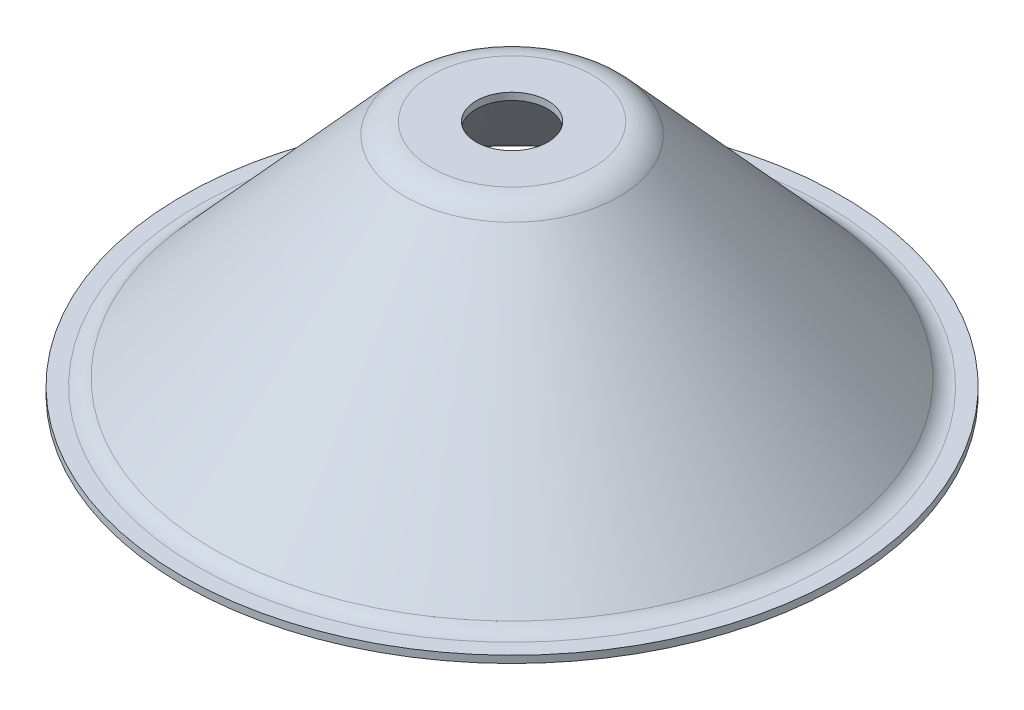
ISO-10303-21;
HEADER;
FILE_DESCRIPTION(('STEP AP214'),'2;1');
FILE_NAME('part.step','',(''),(''),'','','');
FILE_SCHEMA(('AUTOMOTIVE_DESIGN { 1 0 10303 214 1 1 1 1 }'));
ENDSEC;
DATA;
#1=APPLICATION_CONTEXT('core data for automotive mechanical design processes');
#2=APPLICATION_PROTOCOL_DEFINITION('international standard','automotive_design',2000,#1);
#3=PRODUCT_CONTEXT('',#1,'mechanical');
#4=PRODUCT('Part','Part','',(#3));
#5=PRODUCT_RELATED_PRODUCT_CATEGORY('part','',(#4));
#6=PRODUCT_DEFINITION_FORMATION('','',#4);
#7=PRODUCT_DEFINITION_CONTEXT('part definition',#1,'design');
#8=PRODUCT_DEFINITION('design','',#6,#7);
#9=PRODUCT_DEFINITION_SHAPE('','',#8);
#10=(LENGTH_UNIT() NAMED_UNIT(*) SI_UNIT(.MILLI.,.METRE.));
#11=(NAMED_UNIT(*) PLANE_ANGLE_UNIT() SI_UNIT($,.RADIAN.));
#12=(NAMED_UNIT(*) SI_UNIT($,.STERADIAN.) SOLID_ANGLE_UNIT());
#13=UNCERTAINTY_MEASURE_WITH_UNIT(LENGTH_MEASURE(1.E-05),#10,'distance_accuracy_value','');
#14=(GEOMETRIC_REPRESENTATION_CONTEXT(3) GLOBAL_UNCERTAINTY_ASSIGNED_CONTEXT((#13)) GLOBAL_UNIT_ASSIGNED_CONTEXT((#10,
#11,#12)) REPRESENTATION_CONTEXT('',''));
#15=CARTESIAN_POINT('',(0.,0.,0.));
#16=DIRECTION('',(0.,0.,1.));
#17=DIRECTION('',(1.,0.,0.));
#18=AXIS2_PLACEMENT_3D('',#15,#16,#17);
#19=CARTESIAN_POINT('',(11.2267942795777,1.,0.));
#20=DIRECTION('',(0.,-1.,0.));
#21=DIRECTION('',(0.,0.,-1.));
#22=AXIS2_PLACEMENT_3D('',#19,#20,#21);
#23=PLANE('',#22);
#24=CARTESIAN_POINT('',(0.,1.,0.));
#25=DIRECTION('',(0.,1.,0.));
#26=DIRECTION('',(0.,0.,1.));
#27=AXIS2_PLACEMENT_3D('',#24,#25,#26);
#28=CIRCLE('',#27,5.);
#29=CARTESIAN_POINT('',(0.,1.,5.));
#30=VERTEX_POINT('',#29);
#31=EDGE_CURVE('E10',#30,#30,#28,.T.);
#32=ORIENTED_EDGE('',*,*,#31,.F.);
#33=EDGE_LOOP('',(#32));
#34=FACE_BOUND('',#33,.T.);
#35=CARTESIAN_POINT('',(0.,1.,0.));
#36=DIRECTION('',(0.,1.,0.));
#37=DIRECTION('',(0.,0.,1.));
#38=AXIS2_PLACEMENT_3D('',#35,#36,#37);
#39=CIRCLE('',#38,11.2267942795777);
#40=CARTESIAN_POINT('',(0.,1.,11.2267942795777));
#41=VERTEX_POINT('',#40);
#42=EDGE_CURVE('E79',#41,#41,#39,.T.);
#43=ORIENTED_EDGE('',*,*,#42,.T.);
#44=EDGE_LOOP('',(#43));
#45=FACE_BOUND('',#44,.T.);
#46=ADVANCED_FACE('F39',(#34,#45),#23,.F.);
#47=CARTESIAN_POINT('',(0.,23.4158415841584,0.));
#48=DIRECTION('',(0.,1.,0.));
#49=DIRECTION('',(0.,0.,1.));
#50=AXIS2_PLACEMENT_3D('',#47,#48,#49);
#51=CYLINDRICAL_SURFACE('',#50,5.);
#52=ORIENTED_EDGE('',*,*,#31,.T.);
#53=EDGE_LOOP('',(#52));
#54=FACE_BOUND('',#53,.T.);
#55=CARTESIAN_POINT('',(0.,0.,0.));
#56=DIRECTION('',(0.,1.,0.));
#57=DIRECTION('',(0.,0.,1.));
#58=AXIS2_PLACEMENT_3D('',#55,#56,#57);
#59=CIRCLE('',#58,5.);
#60=CARTESIAN_POINT('',(0.,0.,5.));
#61=VERTEX_POINT('',#60);
#62=EDGE_CURVE('E45',#61,#61,#59,.T.);
#63=ORIENTED_EDGE('',*,*,#62,.F.);
#64=EDGE_LOOP('',(#63));
#65=FACE_BOUND('',#64,.T.);
#66=ADVANCED_FACE('F120',(#54,#65),#51,.F.);
#67=CARTESIAN_POINT('',(11.2267942795777,0.,0.));
#68=DIRECTION('',(0.,-1.,0.));
#69=DIRECTION('',(0.,0.,-1.));
#70=AXIS2_PLACEMENT_3D('',#67,#68,#69);
#71=PLANE('',#70);
#72=ORIENTED_EDGE('',*,*,#62,.T.);
#73=EDGE_LOOP('',(#72));
#74=FACE_BOUND('',#73,.T.);
#75=CARTESIAN_POINT('',(0.,0.,0.));
#76=DIRECTION('',(0.,1.,0.));
#77=DIRECTION('',(0.,0.,1.));
#78=AXIS2_PLACEMENT_3D('',#75,#76,#77);
#79=CIRCLE('',#78,11.2267942795777);
#80=CARTESIAN_POINT('',(0.,0.,11.2267942795777));
#81=VERTEX_POINT('',#80);
#82=EDGE_CURVE('E49',#81,#81,#79,.T.);
#83=ORIENTED_EDGE('',*,*,#82,.F.);
#84=EDGE_LOOP('',(#83));
#85=FACE_BOUND('',#84,.T.);
#86=ADVANCED_FACE('F125',(#74,#85),#71,.T.);
#87=CARTESIAN_POINT('',(0.,-4.,0.));
#88=DIRECTION('',(0.,1.,0.));
#89=DIRECTION('',(0.,0.,1.));
#90=AXIS2_PLACEMENT_3D('',#87,#88,#89);
#91=TOROIDAL_SURFACE('',#90,11.2267942795777,4.);
#92=ORIENTED_EDGE('',*,*,#82,.T.);
#93=EDGE_LOOP('',(#92));
#94=FACE_BOUND('',#93,.T.);
#95=CARTESIAN_POINT('',(0.,-1.31392230104456,0.));
#96=DIRECTION('',(0.,1.,0.));
#97=DIRECTION('',(0.,0.,1.));
#98=AXIS2_PLACEMENT_3D('',#95,#96,#97);
#99=CIRCLE('',#98,14.1907420853216);
#100=CARTESIAN_POINT('',(0.,-1.31392230104456,14.1907420853216));
#101=VERTEX_POINT('',#100);
#102=EDGE_CURVE('E53',#101,#101,#99,.T.);
#103=ORIENTED_EDGE('',*,*,#102,.F.);
#104=EDGE_LOOP('',(#103));
#105=FACE_BOUND('',#104,.T.);
#106=ADVANCED_FACE('F129',(#94,#105),#91,.F.);
#107=CARTESIAN_POINT('',(0.,-30.6860776989554,0.));
#108=DIRECTION('',(0.,-1.,0.));
#109=DIRECTION('',(0.,0.,-1.));
#110=AXIS2_PLACEMENT_3D('',#107,#108,#109);
#111=CONICAL_SURFACE('',#110,40.8092579146784,0.736257428981428);
#112=ORIENTED_EDGE('',*,*,#102,.T.);
#113=EDGE_LOOP('',(#112));
#114=FACE_BOUND('',#113,.T.);
#115=CARTESIAN_POINT('',(0.,-30.6860776989554,0.));
#116=DIRECTION('',(0.,1.,0.));
#117=DIRECTION('',(0.,0.,1.));
#118=AXIS2_PLACEMENT_3D('',#115,#116,#117);
#119=CIRCLE('',#118,40.8092579146784);
#120=CARTESIAN_POINT('',(0.,-30.6860776989554,40.8092579146784));
#121=VERTEX_POINT('',#120);
#122=EDGE_CURVE('E58',#121,#121,#119,.T.);
#123=ORIENTED_EDGE('',*,*,#122,.F.);
#124=EDGE_LOOP('',(#123));
#125=FACE_BOUND('',#124,.T.);
#126=ADVANCED_FACE('F135',(#114,#125),#111,.F.);
#127=CARTESIAN_POINT('',(0.,-28.,0.));
#128=DIRECTION('',(0.,1.,0.));
#129=DIRECTION('',(0.,0.,1.));
#130=AXIS2_PLACEMENT_3D('',#127,#128,#129);
#131=TOROIDAL_SURFACE('',#130,43.7732057204223,4.);
#132=ORIENTED_EDGE('',*,*,#122,.T.);
#133=EDGE_LOOP('',(#132));
#134=FACE_BOUND('',#133,.T.);
#135=CARTESIAN_POINT('',(0.,-32.,0.));
#136=DIRECTION('',(0.,1.,0.));
#137=DIRECTION('',(0.,0.,1.));
#138=AXIS2_PLACEMENT_3D('',#135,#136,#137);
#139=CIRCLE('',#138,43.7732057204223);
#140=CARTESIAN_POINT('',(0.,-32.,43.7732057204223));
#141=VERTEX_POINT('',#140);
#142=EDGE_CURVE('E61',#141,#141,#139,.T.);
#143=ORIENTED_EDGE('',*,*,#142,.F.);
#144=EDGE_LOOP('',(#143));
#145=FACE_BOUND('',#144,.T.);
#146=ADVANCED_FACE('F116',(#134,#145),#131,.T.);
#147=CARTESIAN_POINT('',(43.7732057204223,-32.,0.));
#148=DIRECTION('',(0.,-1.,0.));
#149=DIRECTION('',(0.,0.,-1.));
#150=AXIS2_PLACEMENT_3D('',#147,#148,#149);
#151=PLANE('',#150);
#152=ORIENTED_EDGE('',*,*,#142,.T.);
#153=EDGE_LOOP('',(#152));
#154=FACE_BOUND('',#153,.T.);
#155=CARTESIAN_POINT('',(0.,-32.,0.));
#156=DIRECTION('',(0.,1.,0.));
#157=DIRECTION('',(0.,0.,1.));
#158=AXIS2_PLACEMENT_3D('',#155,#156,#157);
#159=CIRCLE('',#158,46.);
#160=CARTESIAN_POINT('',(0.,-32.,46.));
#161=VERTEX_POINT('',#160);
#162=EDGE_CURVE('E64',#161,#161,#159,.T.);
#163=ORIENTED_EDGE('',*,*,#162,.F.);
#164=EDGE_LOOP('',(#163));
#165=FACE_BOUND('',#164,.T.);
#166=ADVANCED_FACE('F110',(#154,#165),#151,.T.);
#167=CARTESIAN_POINT('',(0.,23.4158415841584,0.));
#168=DIRECTION('',(0.,1.,0.));
#169=DIRECTION('',(0.,0.,1.));
#170=AXIS2_PLACEMENT_3D('',#167,#168,#169);
#171=CYLINDRICAL_SURFACE('',#170,46.);
#172=ORIENTED_EDGE('',*,*,#162,.T.);
#173=EDGE_LOOP('',(#172));
#174=FACE_BOUND('',#173,.T.);
#175=CARTESIAN_POINT('',(0.,-31.,0.));
#176=DIRECTION('',(0.,1.,0.));
#177=DIRECTION('',(0.,0.,1.));
#178=AXIS2_PLACEMENT_3D('',#175,#176,#177);
#179=CIRCLE('',#178,46.);
#180=CARTESIAN_POINT('',(0.,-31.,46.));
#181=VERTEX_POINT('',#180);
#182=EDGE_CURVE('E67',#181,#181,#179,.T.);
#183=ORIENTED_EDGE('',*,*,#182,.F.);
#184=EDGE_LOOP('',(#183));
#185=FACE_BOUND('',#184,.T.);
#186=ADVANCED_FACE('F105',(#174,#185),#171,.T.);
#187=CARTESIAN_POINT('',(43.7732057204223,-31.,0.));
#188=DIRECTION('',(0.,-1.,0.));
#189=DIRECTION('',(0.,0.,-1.));
#190=AXIS2_PLACEMENT_3D('',#187,#188,#189);
#191=PLANE('',#190);
#192=CARTESIAN_POINT('',(0.,-31.,0.));
#193=DIRECTION('',(0.,1.,0.));
#194=DIRECTION('',(0.,0.,1.));
#195=AXIS2_PLACEMENT_3D('',#192,#193,#194);
#196=CIRCLE('',#195,43.7732057204223);
#197=CARTESIAN_POINT('',(0.,-31.,43.7732057204223));
#198=VERTEX_POINT('',#197);
#199=EDGE_CURVE('E70',#198,#198,#196,.T.);
#200=ORIENTED_EDGE('',*,*,#199,.F.);
#201=EDGE_LOOP('',(#200));
#202=FACE_BOUND('',#201,.T.);
#203=ORIENTED_EDGE('',*,*,#182,.T.);
#204=EDGE_LOOP('',(#203));
#205=FACE_BOUND('',#204,.T.);
#206=ADVANCED_FACE('F99',(#202,#205),#191,.F.);
#207=CARTESIAN_POINT('',(0.,-28.,0.));
#208=DIRECTION('',(0.,1.,0.));
#209=DIRECTION('',(0.,0.,1.));
#210=AXIS2_PLACEMENT_3D('',#207,#208,#209);
#211=TOROIDAL_SURFACE('',#210,43.7732057204223,3.);
#212=CARTESIAN_POINT('',(0.,-30.0145582742166,0.));
#213=DIRECTION('',(0.,1.,0.));
#214=DIRECTION('',(0.,0.,1.));
#215=AXIS2_PLACEMENT_3D('',#212,#213,#214);
#216=CIRCLE('',#215,41.5502448661144);
#217=CARTESIAN_POINT('',(0.,-30.0145582742166,41.5502448661144));
#218=VERTEX_POINT('',#217);
#219=EDGE_CURVE('E73',#218,#218,#216,.T.);
#220=ORIENTED_EDGE('',*,*,#219,.F.);
#221=EDGE_LOOP('',(#220));
#222=FACE_BOUND('',#221,.T.);
#223=ORIENTED_EDGE('',*,*,#199,.T.);
#224=EDGE_LOOP('',(#223));
#225=FACE_BOUND('',#224,.T.);
#226=ADVANCED_FACE('F93',(#222,#225),#211,.F.);
#227=CARTESIAN_POINT('',(0.,-30.0145582742166,0.));
#228=DIRECTION('',(0.,-1.,0.));
#229=DIRECTION('',(0.,0.,-1.));
#230=AXIS2_PLACEMENT_3D('',#227,#228,#229);
#231=CONICAL_SURFACE('',#230,41.5502448661144,0.736257428981428);
#232=CARTESIAN_POINT('',(0.,-0.642402876305702,0.));
#233=DIRECTION('',(0.,1.,0.));
#234=DIRECTION('',(0.,0.,1.));
#235=AXIS2_PLACEMENT_3D('',#232,#233,#234);
#236=CIRCLE('',#235,14.9317290367576);
#237=CARTESIAN_POINT('',(0.,-0.642402876305702,14.9317290367576));
#238=VERTEX_POINT('',#237);
#239=EDGE_CURVE('E76',#238,#238,#236,.T.);
#240=ORIENTED_EDGE('',*,*,#239,.F.);
#241=EDGE_LOOP('',(#240));
#242=FACE_BOUND('',#241,.T.);
#243=ORIENTED_EDGE('',*,*,#219,.T.);
#244=EDGE_LOOP('',(#243));
#245=FACE_BOUND('',#244,.T.);
#246=ADVANCED_FACE('F87',(#242,#245),#231,.T.);
#247=CARTESIAN_POINT('',(0.,-4.,0.));
#248=DIRECTION('',(0.,1.,0.));
#249=DIRECTION('',(0.,0.,1.));
#250=AXIS2_PLACEMENT_3D('',#247,#248,#249);
#251=TOROIDAL_SURFACE('',#250,11.2267942795777,5.);
#252=ORIENTED_EDGE('',*,*,#42,.F.);
#253=EDGE_LOOP('',(#252));
#254=FACE_BOUND('',#253,.T.);
#255=ORIENTED_EDGE('',*,*,#239,.T.);
#256=EDGE_LOOP('',(#255));
#257=FACE_BOUND('',#256,.T.);
#258=ADVANCED_FACE('F84',(#254,#257),#251,.T.);
#259=CLOSED_SHELL('',(#46,#66,#86,#106,#126,#146,#166,#186,#206,#226,#246,#258));
#260=MANIFOLD_SOLID_BREP('B2',#259);
#261=ADVANCED_BREP_SHAPE_REPRESENTATION('',(#18,#260),#14);
#262=SHAPE_DEFINITION_REPRESENTATION(#9,#261);
ENDSEC;
END-ISO-10303-21;
